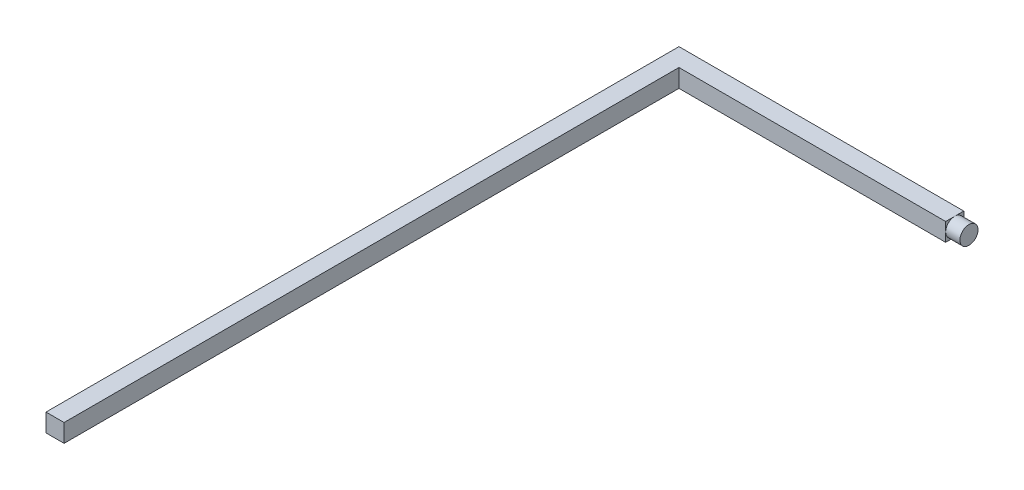
ISO-10303-21;
HEADER;
FILE_DESCRIPTION(('STEP AP214'),'2;1');
FILE_NAME('part.step','',(''),(''),'','','');
FILE_SCHEMA(('AUTOMOTIVE_DESIGN { 1 0 10303 214 1 1 1 1 }'));
ENDSEC;
DATA;
#1=APPLICATION_CONTEXT('core data for automotive mechanical design processes');
#2=APPLICATION_PROTOCOL_DEFINITION('international standard','automotive_design',2000,#1);
#3=PRODUCT_CONTEXT('',#1,'mechanical');
#4=PRODUCT('Part','Part','',(#3));
#5=PRODUCT_RELATED_PRODUCT_CATEGORY('part','',(#4));
#6=PRODUCT_DEFINITION_FORMATION('','',#4);
#7=PRODUCT_DEFINITION_CONTEXT('part definition',#1,'design');
#8=PRODUCT_DEFINITION('design','',#6,#7);
#9=PRODUCT_DEFINITION_SHAPE('','',#8);
#10=(LENGTH_UNIT() NAMED_UNIT(*) SI_UNIT(.MILLI.,.METRE.));
#11=(NAMED_UNIT(*) PLANE_ANGLE_UNIT() SI_UNIT($,.RADIAN.));
#12=(NAMED_UNIT(*) SI_UNIT($,.STERADIAN.) SOLID_ANGLE_UNIT());
#13=UNCERTAINTY_MEASURE_WITH_UNIT(LENGTH_MEASURE(1.E-05),#10,'distance_accuracy_value','');
#14=(GEOMETRIC_REPRESENTATION_CONTEXT(3) GLOBAL_UNCERTAINTY_ASSIGNED_CONTEXT((#13)) GLOBAL_UNIT_ASSIGNED_CONTEXT((#10,
#11,#12)) REPRESENTATION_CONTEXT('',''));
#15=CARTESIAN_POINT('',(0.,0.,0.));
#16=DIRECTION('',(0.,0.,1.));
#17=DIRECTION('',(1.,0.,0.));
#18=AXIS2_PLACEMENT_3D('',#15,#16,#17);
#19=CARTESIAN_POINT('',(19.365,0.635,0.));
#20=DIRECTION('',(1.,0.,0.));
#21=DIRECTION('',(0.,0.,-1.));
#22=AXIS2_PLACEMENT_3D('',#19,#20,#21);
#23=PLANE('',#22);
#24=CARTESIAN_POINT('',(19.365,0.,-21.59));
#25=DIRECTION('',(1.,0.,0.));
#26=DIRECTION('',(0.,0.,-1.));
#27=AXIS2_PLACEMENT_3D('',#24,#25,#26);
#28=CIRCLE('',#27,0.634999999999999);
#29=CARTESIAN_POINT('',(19.365,0.,-22.225));
#30=VERTEX_POINT('',#29);
#31=CARTESIAN_POINT('',(19.365,0.635,-21.59));
#32=VERTEX_POINT('',#31);
#33=EDGE_CURVE('E55',#30,#32,#28,.T.);
#34=ORIENTED_EDGE('',*,*,#33,.F.);
#35=DIRECTION('',(0.,-1.,0.));
#36=VECTOR('',#35,1.);
#37=CARTESIAN_POINT('',(19.365,0.635,-22.225));
#38=LINE('',#37,#36);
#39=CARTESIAN_POINT('',(19.365,0.635,-22.225));
#40=VERTEX_POINT('',#39);
#41=EDGE_CURVE('E47',#40,#30,#38,.T.);
#42=ORIENTED_EDGE('',*,*,#41,.F.);
#43=DIRECTION('',(0.,0.,1.));
#44=VECTOR('',#43,1.);
#45=CARTESIAN_POINT('',(19.365,0.635,0.));
#46=LINE('',#45,#44);
#47=EDGE_CURVE('E131',#40,#32,#46,.T.);
#48=ORIENTED_EDGE('',*,*,#47,.T.);
#49=EDGE_LOOP('',(#34,#42,#48));
#50=FACE_BOUND('',#49,.T.);
#51=ADVANCED_FACE('F43',(#50),#23,.T.);
#52=CARTESIAN_POINT('',(19.365,0.,-20.955));
#53=VERTEX_POINT('',#52);
#54=EDGE_CURVE('E11',#32,#53,#28,.T.);
#55=ORIENTED_EDGE('',*,*,#54,.F.);
#56=CARTESIAN_POINT('',(19.365,0.635,-20.955));
#57=VERTEX_POINT('',#56);
#58=EDGE_CURVE('E142',#32,#57,#46,.T.);
#59=ORIENTED_EDGE('',*,*,#58,.T.);
#60=DIRECTION('',(0.,-1.,0.));
#61=VECTOR('',#60,1.);
#62=CARTESIAN_POINT('',(19.365,0.635,-20.955));
#63=LINE('',#62,#61);
#64=EDGE_CURVE('E180',#57,#53,#63,.T.);
#65=ORIENTED_EDGE('',*,*,#64,.T.);
#66=EDGE_LOOP('',(#55,#59,#65));
#67=FACE_BOUND('',#66,.T.);
#68=ADVANCED_FACE('F235',(#67),#23,.T.);
#69=CARTESIAN_POINT('',(19.365,-0.635,-21.59));
#70=VERTEX_POINT('',#69);
#71=EDGE_CURVE('E53',#53,#70,#28,.T.);
#72=ORIENTED_EDGE('',*,*,#71,.F.);
#73=CARTESIAN_POINT('',(19.365,-0.635,-20.955));
#74=VERTEX_POINT('',#73);
#75=EDGE_CURVE('E159',#53,#74,#63,.T.);
#76=ORIENTED_EDGE('',*,*,#75,.T.);
#77=DIRECTION('',(0.,0.,1.));
#78=VECTOR('',#77,1.);
#79=CARTESIAN_POINT('',(19.365,-0.635,0.));
#80=LINE('',#79,#78);
#81=EDGE_CURVE('E163',#70,#74,#80,.T.);
#82=ORIENTED_EDGE('',*,*,#81,.F.);
#83=EDGE_LOOP('',(#72,#76,#82));
#84=FACE_BOUND('',#83,.T.);
#85=ADVANCED_FACE('F240',(#84),#23,.T.);
#86=EDGE_CURVE('E122',#70,#30,#28,.T.);
#87=ORIENTED_EDGE('',*,*,#86,.F.);
#88=CARTESIAN_POINT('',(19.365,-0.635,-22.225));
#89=VERTEX_POINT('',#88);
#90=EDGE_CURVE('E126',#89,#70,#80,.T.);
#91=ORIENTED_EDGE('',*,*,#90,.F.);
#92=EDGE_CURVE('E113',#30,#89,#38,.T.);
#93=ORIENTED_EDGE('',*,*,#92,.F.);
#94=EDGE_LOOP('',(#87,#91,#93));
#95=FACE_BOUND('',#94,.T.);
#96=ADVANCED_FACE('F45',(#95),#23,.T.);
#97=CARTESIAN_POINT('',(0.,0.635,-22.225));
#98=DIRECTION('',(0.,0.,-1.));
#99=DIRECTION('',(-1.,0.,0.));
#100=AXIS2_PLACEMENT_3D('',#97,#98,#99);
#101=PLANE('',#100);
#102=DIRECTION('',(1.,0.,0.));
#103=VECTOR('',#102,1.);
#104=CARTESIAN_POINT('',(0.,-0.635,-22.225));
#105=LINE('',#104,#103);
#106=CARTESIAN_POINT('',(-0.635,-0.635,-22.225));
#107=VERTEX_POINT('',#106);
#108=EDGE_CURVE('E162',#107,#89,#105,.T.);
#109=ORIENTED_EDGE('',*,*,#108,.F.);
#110=DIRECTION('',(0.,-1.,0.));
#111=VECTOR('',#110,1.);
#112=CARTESIAN_POINT('',(-0.635,0.635,-22.225));
#113=LINE('',#112,#111);
#114=CARTESIAN_POINT('',(-0.635,0.635,-22.225));
#115=VERTEX_POINT('',#114);
#116=EDGE_CURVE('E129',#115,#107,#113,.T.);
#117=ORIENTED_EDGE('',*,*,#116,.F.);
#118=DIRECTION('',(1.,0.,0.));
#119=VECTOR('',#118,1.);
#120=CARTESIAN_POINT('',(0.,0.635,-22.225));
#121=LINE('',#120,#119);
#122=EDGE_CURVE('E116',#115,#40,#121,.T.);
#123=ORIENTED_EDGE('',*,*,#122,.T.);
#124=ORIENTED_EDGE('',*,*,#41,.T.);
#125=ORIENTED_EDGE('',*,*,#92,.T.);
#126=EDGE_LOOP('',(#109,#117,#123,#124,#125));
#127=FACE_BOUND('',#126,.T.);
#128=ADVANCED_FACE('F112',(#127),#101,.T.);
#129=CARTESIAN_POINT('',(-0.635,0.635,0.));
#130=DIRECTION('',(-1.,0.,0.));
#131=DIRECTION('',(0.,0.,1.));
#132=AXIS2_PLACEMENT_3D('',#129,#130,#131);
#133=PLANE('',#132);
#134=DIRECTION('',(0.,0.,-1.));
#135=VECTOR('',#134,1.);
#136=CARTESIAN_POINT('',(-0.635,-0.635,0.));
#137=LINE('',#136,#135);
#138=CARTESIAN_POINT('',(-0.635,-0.635,22.225));
#139=VERTEX_POINT('',#138);
#140=EDGE_CURVE('E166',#139,#107,#137,.T.);
#141=ORIENTED_EDGE('',*,*,#140,.F.);
#142=DIRECTION('',(0.,-1.,0.));
#143=VECTOR('',#142,1.);
#144=CARTESIAN_POINT('',(-0.635,0.635,22.225));
#145=LINE('',#144,#143);
#146=CARTESIAN_POINT('',(-0.635,0.635,22.225));
#147=VERTEX_POINT('',#146);
#148=EDGE_CURVE('E191',#147,#139,#145,.T.);
#149=ORIENTED_EDGE('',*,*,#148,.F.);
#150=DIRECTION('',(0.,0.,-1.));
#151=VECTOR('',#150,1.);
#152=CARTESIAN_POINT('',(-0.635,0.635,0.));
#153=LINE('',#152,#151);
#154=EDGE_CURVE('E145',#147,#115,#153,.T.);
#155=ORIENTED_EDGE('',*,*,#154,.T.);
#156=ORIENTED_EDGE('',*,*,#116,.T.);
#157=EDGE_LOOP('',(#141,#149,#155,#156));
#158=FACE_BOUND('',#157,.T.);
#159=ADVANCED_FACE('F196',(#158),#133,.T.);
#160=CARTESIAN_POINT('',(0.,0.635,22.225));
#161=DIRECTION('',(0.,0.,-1.));
#162=DIRECTION('',(-1.,0.,0.));
#163=AXIS2_PLACEMENT_3D('',#160,#161,#162);
#164=PLANE('',#163);
#165=DIRECTION('',(1.,0.,0.));
#166=VECTOR('',#165,1.);
#167=CARTESIAN_POINT('',(0.,-0.635,22.225));
#168=LINE('',#167,#166);
#169=CARTESIAN_POINT('',(0.635,-0.635,22.225));
#170=VERTEX_POINT('',#169);
#171=EDGE_CURVE('E170',#139,#170,#168,.T.);
#172=ORIENTED_EDGE('',*,*,#171,.T.);
#173=DIRECTION('',(0.,-1.,0.));
#174=VECTOR('',#173,1.);
#175=CARTESIAN_POINT('',(0.635,0.635,22.225));
#176=LINE('',#175,#174);
#177=CARTESIAN_POINT('',(0.635,0.635,22.225));
#178=VERTEX_POINT('',#177);
#179=EDGE_CURVE('E187',#178,#170,#176,.T.);
#180=ORIENTED_EDGE('',*,*,#179,.F.);
#181=DIRECTION('',(1.,0.,0.));
#182=VECTOR('',#181,1.);
#183=CARTESIAN_POINT('',(0.,0.635,22.225));
#184=LINE('',#183,#182);
#185=EDGE_CURVE('E149',#147,#178,#184,.T.);
#186=ORIENTED_EDGE('',*,*,#185,.F.);
#187=ORIENTED_EDGE('',*,*,#148,.T.);
#188=EDGE_LOOP('',(#172,#180,#186,#187));
#189=FACE_BOUND('',#188,.T.);
#190=ADVANCED_FACE('F205',(#189),#164,.F.);
#191=CARTESIAN_POINT('',(0.635,0.635,0.));
#192=DIRECTION('',(-1.,0.,0.));
#193=DIRECTION('',(0.,0.,1.));
#194=AXIS2_PLACEMENT_3D('',#191,#192,#193);
#195=PLANE('',#194);
#196=DIRECTION('',(0.,0.,-1.));
#197=VECTOR('',#196,1.);
#198=CARTESIAN_POINT('',(0.635,-0.635,0.));
#199=LINE('',#198,#197);
#200=CARTESIAN_POINT('',(0.635,-0.635,-20.955));
#201=VERTEX_POINT('',#200);
#202=EDGE_CURVE('E173',#170,#201,#199,.T.);
#203=ORIENTED_EDGE('',*,*,#202,.T.);
#204=DIRECTION('',(0.,-1.,0.));
#205=VECTOR('',#204,1.);
#206=CARTESIAN_POINT('',(0.635,0.635,-20.955));
#207=LINE('',#206,#205);
#208=CARTESIAN_POINT('',(0.635,0.635,-20.955));
#209=VERTEX_POINT('',#208);
#210=EDGE_CURVE('E183',#209,#201,#207,.T.);
#211=ORIENTED_EDGE('',*,*,#210,.F.);
#212=DIRECTION('',(0.,0.,-1.));
#213=VECTOR('',#212,1.);
#214=CARTESIAN_POINT('',(0.635,0.635,0.));
#215=LINE('',#214,#213);
#216=EDGE_CURVE('E152',#178,#209,#215,.T.);
#217=ORIENTED_EDGE('',*,*,#216,.F.);
#218=ORIENTED_EDGE('',*,*,#179,.T.);
#219=EDGE_LOOP('',(#203,#211,#217,#218));
#220=FACE_BOUND('',#219,.T.);
#221=ADVANCED_FACE('F209',(#220),#195,.F.);
#222=CARTESIAN_POINT('',(0.,0.635,-20.955));
#223=DIRECTION('',(0.,0.,-1.));
#224=DIRECTION('',(-1.,0.,0.));
#225=AXIS2_PLACEMENT_3D('',#222,#223,#224);
#226=PLANE('',#225);
#227=DIRECTION('',(1.,0.,0.));
#228=VECTOR('',#227,1.);
#229=CARTESIAN_POINT('',(0.,-0.635,-20.955));
#230=LINE('',#229,#228);
#231=EDGE_CURVE('E176',#201,#74,#230,.T.);
#232=ORIENTED_EDGE('',*,*,#231,.T.);
#233=ORIENTED_EDGE('',*,*,#75,.F.);
#234=ORIENTED_EDGE('',*,*,#64,.F.);
#235=DIRECTION('',(1.,0.,0.));
#236=VECTOR('',#235,1.);
#237=CARTESIAN_POINT('',(0.,0.635,-20.955));
#238=LINE('',#237,#236);
#239=EDGE_CURVE('E155',#209,#57,#238,.T.);
#240=ORIENTED_EDGE('',*,*,#239,.F.);
#241=ORIENTED_EDGE('',*,*,#210,.T.);
#242=EDGE_LOOP('',(#232,#233,#234,#240,#241));
#243=FACE_BOUND('',#242,.T.);
#244=ADVANCED_FACE('F287',(#243),#226,.F.);
#245=CARTESIAN_POINT('',(0.,0.635,0.));
#246=DIRECTION('',(0.,1.,0.));
#247=DIRECTION('',(0.,0.,1.));
#248=AXIS2_PLACEMENT_3D('',#245,#246,#247);
#249=PLANE('',#248);
#250=ORIENTED_EDGE('',*,*,#47,.F.);
#251=ORIENTED_EDGE('',*,*,#122,.F.);
#252=ORIENTED_EDGE('',*,*,#154,.F.);
#253=ORIENTED_EDGE('',*,*,#185,.T.);
#254=ORIENTED_EDGE('',*,*,#216,.T.);
#255=ORIENTED_EDGE('',*,*,#239,.T.);
#256=ORIENTED_EDGE('',*,*,#58,.F.);
#257=EDGE_LOOP('',(#250,#251,#252,#253,#254,#255,#256));
#258=FACE_BOUND('',#257,.T.);
#259=ADVANCED_FACE('F213',(#258),#249,.T.);
#260=CARTESIAN_POINT('',(0.,-0.635,0.));
#261=DIRECTION('',(0.,1.,0.));
#262=DIRECTION('',(0.,0.,1.));
#263=AXIS2_PLACEMENT_3D('',#260,#261,#262);
#264=PLANE('',#263);
#265=ORIENTED_EDGE('',*,*,#90,.T.);
#266=ORIENTED_EDGE('',*,*,#81,.T.);
#267=ORIENTED_EDGE('',*,*,#231,.F.);
#268=ORIENTED_EDGE('',*,*,#202,.F.);
#269=ORIENTED_EDGE('',*,*,#171,.F.);
#270=ORIENTED_EDGE('',*,*,#140,.T.);
#271=ORIENTED_EDGE('',*,*,#108,.T.);
#272=EDGE_LOOP('',(#265,#266,#267,#268,#269,#270,#271));
#273=FACE_BOUND('',#272,.T.);
#274=ADVANCED_FACE('F200',(#273),#264,.F.);
#275=CARTESIAN_POINT('',(20.365,0.,-21.59));
#276=DIRECTION('',(-1.,0.,0.));
#277=DIRECTION('',(0.,0.,1.));
#278=AXIS2_PLACEMENT_3D('',#275,#276,#277);
#279=CYLINDRICAL_SURFACE('',#278,0.634999999999999);
#280=CARTESIAN_POINT('',(20.365,0.,-21.59));
#281=DIRECTION('',(1.,0.,0.));
#282=DIRECTION('',(0.,0.,-1.));
#283=AXIS2_PLACEMENT_3D('',#280,#281,#282);
#284=CIRCLE('',#283,0.634999999999999);
#285=CARTESIAN_POINT('',(20.365,0.,-22.225));
#286=VERTEX_POINT('',#285);
#287=EDGE_CURVE('E134',#286,#286,#284,.T.);
#288=ORIENTED_EDGE('',*,*,#287,.F.);
#289=EDGE_LOOP('',(#288));
#290=FACE_BOUND('',#289,.T.);
#291=ORIENTED_EDGE('',*,*,#33,.T.);
#292=ORIENTED_EDGE('',*,*,#54,.T.);
#293=ORIENTED_EDGE('',*,*,#71,.T.);
#294=ORIENTED_EDGE('',*,*,#86,.T.);
#295=EDGE_LOOP('',(#291,#292,#293,#294));
#296=FACE_BOUND('',#295,.T.);
#297=ADVANCED_FACE('F135',(#290,#296),#279,.T.);
#298=CARTESIAN_POINT('',(20.365,0.,-21.59));
#299=DIRECTION('',(1.,0.,0.));
#300=DIRECTION('',(0.,0.,-1.));
#301=AXIS2_PLACEMENT_3D('',#298,#299,#300);
#302=PLANE('',#301);
#303=ORIENTED_EDGE('',*,*,#287,.T.);
#304=EDGE_LOOP('',(#303));
#305=FACE_BOUND('',#304,.T.);
#306=ADVANCED_FACE('F222',(#305),#302,.T.);
#307=CLOSED_SHELL('',(#51,#68,#85,#96,#128,#159,#190,#221,#244,#259,#274,#297,#306));
#308=MANIFOLD_SOLID_BREP('B2',#307);
#309=ADVANCED_BREP_SHAPE_REPRESENTATION('',(#18,#308),#14);
#310=SHAPE_DEFINITION_REPRESENTATION(#9,#309);
ENDSEC;
END-ISO-10303-21;
